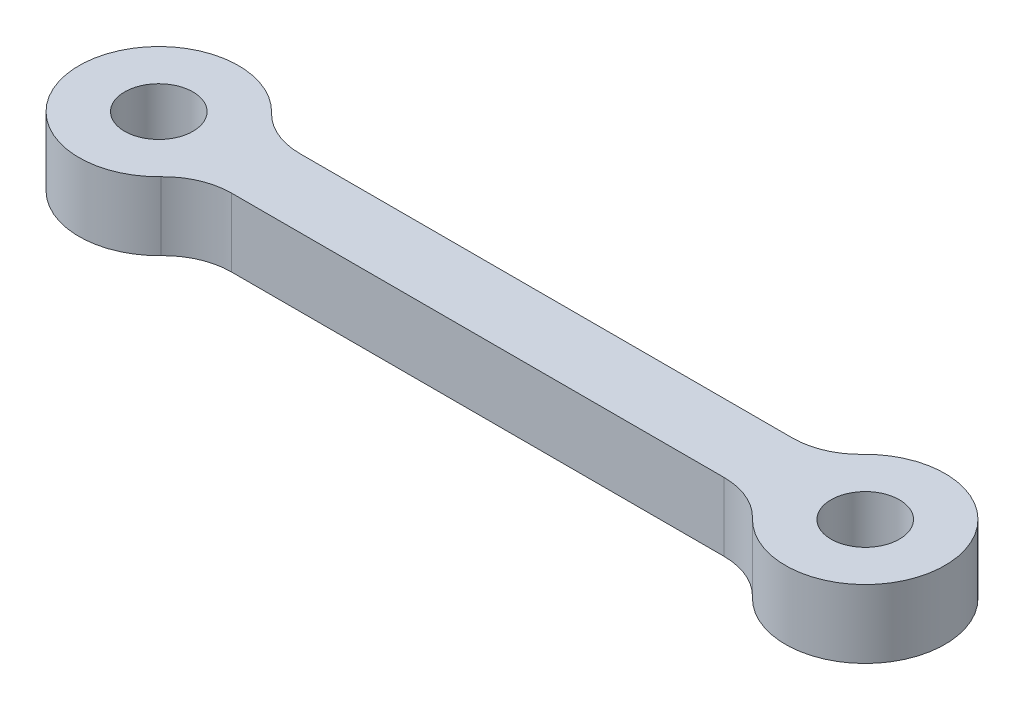
ISO-10303-21;
HEADER;
FILE_DESCRIPTION(('STEP AP214'),'2;1');
FILE_NAME('part.step','',(''),(''),'','','');
FILE_SCHEMA(('AUTOMOTIVE_DESIGN { 1 0 10303 214 1 1 1 1 }'));
ENDSEC;
DATA;
#1=APPLICATION_CONTEXT('core data for automotive mechanical design processes');
#2=APPLICATION_PROTOCOL_DEFINITION('international standard','automotive_design',2000,#1);
#3=PRODUCT_CONTEXT('',#1,'mechanical');
#4=PRODUCT('Part','Part','',(#3));
#5=PRODUCT_RELATED_PRODUCT_CATEGORY('part','',(#4));
#6=PRODUCT_DEFINITION_FORMATION('','',#4);
#7=PRODUCT_DEFINITION_CONTEXT('part definition',#1,'design');
#8=PRODUCT_DEFINITION('design','',#6,#7);
#9=PRODUCT_DEFINITION_SHAPE('','',#8);
#10=(LENGTH_UNIT() NAMED_UNIT(*) SI_UNIT(.MILLI.,.METRE.));
#11=(NAMED_UNIT(*) PLANE_ANGLE_UNIT() SI_UNIT($,.RADIAN.));
#12=(NAMED_UNIT(*) SI_UNIT($,.STERADIAN.) SOLID_ANGLE_UNIT());
#13=UNCERTAINTY_MEASURE_WITH_UNIT(LENGTH_MEASURE(1.E-05),#10,'distance_accuracy_value','');
#14=(GEOMETRIC_REPRESENTATION_CONTEXT(3) GLOBAL_UNCERTAINTY_ASSIGNED_CONTEXT((#13)) GLOBAL_UNIT_ASSIGNED_CONTEXT((#10,
#11,#12)) REPRESENTATION_CONTEXT('',''));
#15=CARTESIAN_POINT('',(0.,0.,0.));
#16=DIRECTION('',(0.,0.,1.));
#17=DIRECTION('',(1.,0.,0.));
#18=AXIS2_PLACEMENT_3D('',#15,#16,#17);
#19=CARTESIAN_POINT('',(31.,3.,0.));
#20=DIRECTION('',(0.,-1.,0.));
#21=DIRECTION('',(0.,0.,-1.));
#22=AXIS2_PLACEMENT_3D('',#19,#20,#21);
#23=CYLINDRICAL_SURFACE('',#22,3.5);
#24=CARTESIAN_POINT('',(31.,3.,0.));
#25=DIRECTION('',(0.,1.,0.));
#26=DIRECTION('',(0.,0.,1.));
#27=AXIS2_PLACEMENT_3D('',#24,#25,#26);
#28=CIRCLE('',#27,3.5);
#29=CARTESIAN_POINT('',(28.4743915139412,3.,2.42307692307692));
#30=VERTEX_POINT('',#29);
#31=CARTESIAN_POINT('',(28.4743915139412,3.,-2.42307692307692));
#32=VERTEX_POINT('',#31);
#33=EDGE_CURVE('E142',#30,#32,#28,.T.);
#34=ORIENTED_EDGE('',*,*,#33,.F.);
#35=DIRECTION('',(0.,-1.,0.));
#36=VECTOR('',#35,1.);
#37=CARTESIAN_POINT('',(28.4743915139412,3.,2.42307692307692));
#38=LINE('',#37,#36);
#39=CARTESIAN_POINT('',(28.4743915139412,0.,2.42307692307692));
#40=VERTEX_POINT('',#39);
#41=EDGE_CURVE('E150',#30,#40,#38,.T.);
#42=ORIENTED_EDGE('',*,*,#41,.T.);
#43=CARTESIAN_POINT('',(31.,0.,0.));
#44=DIRECTION('',(0.,1.,0.));
#45=DIRECTION('',(0.,0.,1.));
#46=AXIS2_PLACEMENT_3D('',#43,#44,#45);
#47=CIRCLE('',#46,3.5);
#48=CARTESIAN_POINT('',(28.4743915139412,0.,-2.42307692307692));
#49=VERTEX_POINT('',#48);
#50=EDGE_CURVE('E167',#40,#49,#47,.T.);
#51=ORIENTED_EDGE('',*,*,#50,.T.);
#52=DIRECTION('',(0.,-1.,0.));
#53=VECTOR('',#52,1.);
#54=CARTESIAN_POINT('',(28.4743915139412,3.,-2.42307692307692));
#55=LINE('',#54,#53);
#56=EDGE_CURVE('E148',#49,#32,#55,.F.);
#57=ORIENTED_EDGE('',*,*,#56,.T.);
#58=EDGE_LOOP('',(#34,#42,#51,#57));
#59=FACE_BOUND('',#58,.T.);
#60=ADVANCED_FACE('F36',(#59),#23,.T.);
#61=CARTESIAN_POINT('',(0.,3.,-1.5));
#62=DIRECTION('',(0.,0.,-1.));
#63=DIRECTION('',(-1.,0.,0.));
#64=AXIS2_PLACEMENT_3D('',#61,#62,#63);
#65=PLANE('',#64);
#66=DIRECTION('',(1.,0.,0.));
#67=VECTOR('',#66,1.);
#68=CARTESIAN_POINT('',(0.,3.,-1.5));
#69=LINE('',#68,#67);
#70=CARTESIAN_POINT('',(4.69041575982343,3.,-1.5));
#71=VERTEX_POINT('',#70);
#72=CARTESIAN_POINT('',(26.3095842401766,3.,-1.5));
#73=VERTEX_POINT('',#72);
#74=EDGE_CURVE('E174',#71,#73,#69,.T.);
#75=ORIENTED_EDGE('',*,*,#74,.T.);
#76=DIRECTION('',(0.,-1.,0.));
#77=VECTOR('',#76,1.);
#78=CARTESIAN_POINT('',(26.3095842401766,3.,-1.5));
#79=LINE('',#78,#77);
#80=CARTESIAN_POINT('',(26.3095842401766,0.,-1.5));
#81=VERTEX_POINT('',#80);
#82=EDGE_CURVE('E113',#73,#81,#79,.T.);
#83=ORIENTED_EDGE('',*,*,#82,.T.);
#84=DIRECTION('',(1.,0.,0.));
#85=VECTOR('',#84,1.);
#86=CARTESIAN_POINT('',(0.,0.,-1.5));
#87=LINE('',#86,#85);
#88=CARTESIAN_POINT('',(4.69041575982343,0.,-1.5));
#89=VERTEX_POINT('',#88);
#90=EDGE_CURVE('E136',#89,#81,#87,.T.);
#91=ORIENTED_EDGE('',*,*,#90,.F.);
#92=DIRECTION('',(0.,-1.,0.));
#93=VECTOR('',#92,1.);
#94=CARTESIAN_POINT('',(4.69041575982343,3.,-1.5));
#95=LINE('',#94,#93);
#96=EDGE_CURVE('E58',#89,#71,#95,.F.);
#97=ORIENTED_EDGE('',*,*,#96,.T.);
#98=EDGE_LOOP('',(#75,#83,#91,#97));
#99=FACE_BOUND('',#98,.T.);
#100=ADVANCED_FACE('F165',(#99),#65,.T.);
#101=CARTESIAN_POINT('',(0.,3.,0.));
#102=DIRECTION('',(0.,-1.,0.));
#103=DIRECTION('',(0.,0.,-1.));
#104=AXIS2_PLACEMENT_3D('',#101,#102,#103);
#105=CYLINDRICAL_SURFACE('',#104,3.5);
#106=CARTESIAN_POINT('',(0.,0.,0.));
#107=DIRECTION('',(0.,1.,0.));
#108=DIRECTION('',(0.,0.,1.));
#109=AXIS2_PLACEMENT_3D('',#106,#107,#108);
#110=CIRCLE('',#109,3.5);
#111=CARTESIAN_POINT('',(2.52560848605877,0.,-2.42307692307692));
#112=VERTEX_POINT('',#111);
#113=CARTESIAN_POINT('',(2.52560848605877,0.,2.42307692307692));
#114=VERTEX_POINT('',#113);
#115=EDGE_CURVE('E131',#112,#114,#110,.T.);
#116=ORIENTED_EDGE('',*,*,#115,.T.);
#117=DIRECTION('',(0.,-1.,0.));
#118=VECTOR('',#117,1.);
#119=CARTESIAN_POINT('',(2.52560848605877,3.,2.42307692307692));
#120=LINE('',#119,#118);
#121=CARTESIAN_POINT('',(2.52560848605877,3.,2.42307692307692));
#122=VERTEX_POINT('',#121);
#123=EDGE_CURVE('E107',#114,#122,#120,.F.);
#124=ORIENTED_EDGE('',*,*,#123,.T.);
#125=CARTESIAN_POINT('',(0.,3.,0.));
#126=DIRECTION('',(0.,1.,0.));
#127=DIRECTION('',(0.,0.,1.));
#128=AXIS2_PLACEMENT_3D('',#125,#126,#127);
#129=CIRCLE('',#128,3.5);
#130=CARTESIAN_POINT('',(2.52560848605877,3.,-2.42307692307692));
#131=VERTEX_POINT('',#130);
#132=EDGE_CURVE('E173',#131,#122,#129,.T.);
#133=ORIENTED_EDGE('',*,*,#132,.F.);
#134=DIRECTION('',(0.,-1.,0.));
#135=VECTOR('',#134,1.);
#136=CARTESIAN_POINT('',(2.52560848605877,3.,-2.42307692307692));
#137=LINE('',#136,#135);
#138=EDGE_CURVE('E123',#131,#112,#137,.T.);
#139=ORIENTED_EDGE('',*,*,#138,.T.);
#140=EDGE_LOOP('',(#116,#124,#133,#139));
#141=FACE_BOUND('',#140,.T.);
#142=ADVANCED_FACE('F176',(#141),#105,.T.);
#143=CARTESIAN_POINT('',(0.,3.,0.));
#144=DIRECTION('',(0.,-1.,0.));
#145=DIRECTION('',(0.,0.,-1.));
#146=AXIS2_PLACEMENT_3D('',#143,#144,#145);
#147=CYLINDRICAL_SURFACE('',#146,1.5);
#148=CARTESIAN_POINT('',(0.,3.,0.));
#149=DIRECTION('',(0.,1.,0.));
#150=DIRECTION('',(0.,0.,1.));
#151=AXIS2_PLACEMENT_3D('',#148,#149,#150);
#152=CIRCLE('',#151,1.5);
#153=CARTESIAN_POINT('',(0.,3.,1.5));
#154=VERTEX_POINT('',#153);
#155=EDGE_CURVE('E178',#154,#154,#152,.T.);
#156=ORIENTED_EDGE('',*,*,#155,.T.);
#157=EDGE_LOOP('',(#156));
#158=FACE_BOUND('',#157,.T.);
#159=CARTESIAN_POINT('',(0.,0.,0.));
#160=DIRECTION('',(0.,1.,0.));
#161=DIRECTION('',(0.,0.,1.));
#162=AXIS2_PLACEMENT_3D('',#159,#160,#161);
#163=CIRCLE('',#162,1.5);
#164=CARTESIAN_POINT('',(0.,0.,1.5));
#165=VERTEX_POINT('',#164);
#166=EDGE_CURVE('E130',#165,#165,#163,.T.);
#167=ORIENTED_EDGE('',*,*,#166,.F.);
#168=EDGE_LOOP('',(#167));
#169=FACE_BOUND('',#168,.T.);
#170=ADVANCED_FACE('F224',(#158,#169),#147,.F.);
#171=CARTESIAN_POINT('',(0.,3.,1.5));
#172=DIRECTION('',(0.,0.,-1.));
#173=DIRECTION('',(-1.,0.,0.));
#174=AXIS2_PLACEMENT_3D('',#171,#172,#173);
#175=PLANE('',#174);
#176=DIRECTION('',(1.,0.,0.));
#177=VECTOR('',#176,1.);
#178=CARTESIAN_POINT('',(0.,3.,1.5));
#179=LINE('',#178,#177);
#180=CARTESIAN_POINT('',(4.69041575982343,3.,1.5));
#181=VERTEX_POINT('',#180);
#182=CARTESIAN_POINT('',(26.3095842401766,3.,1.5));
#183=VERTEX_POINT('',#182);
#184=EDGE_CURVE('E122',#181,#183,#179,.T.);
#185=ORIENTED_EDGE('',*,*,#184,.F.);
#186=DIRECTION('',(0.,1.,0.));
#187=VECTOR('',#186,1.);
#188=CARTESIAN_POINT('',(4.69041575982343,0.,1.5));
#189=LINE('',#188,#187);
#190=CARTESIAN_POINT('',(4.69041575982343,0.,1.5));
#191=VERTEX_POINT('',#190);
#192=EDGE_CURVE('E106',#181,#191,#189,.F.);
#193=ORIENTED_EDGE('',*,*,#192,.T.);
#194=DIRECTION('',(1.,0.,0.));
#195=VECTOR('',#194,1.);
#196=CARTESIAN_POINT('',(0.,0.,1.5));
#197=LINE('',#196,#195);
#198=CARTESIAN_POINT('',(26.3095842401766,0.,1.5));
#199=VERTEX_POINT('',#198);
#200=EDGE_CURVE('E119',#191,#199,#197,.T.);
#201=ORIENTED_EDGE('',*,*,#200,.T.);
#202=DIRECTION('',(0.,1.,0.));
#203=VECTOR('',#202,1.);
#204=CARTESIAN_POINT('',(26.3095842401766,3.,1.5));
#205=LINE('',#204,#203);
#206=EDGE_CURVE('E124',#199,#183,#205,.T.);
#207=ORIENTED_EDGE('',*,*,#206,.T.);
#208=EDGE_LOOP('',(#185,#193,#201,#207));
#209=FACE_BOUND('',#208,.T.);
#210=ADVANCED_FACE('F118',(#209),#175,.F.);
#211=CARTESIAN_POINT('',(31.,3.,0.));
#212=DIRECTION('',(0.,-1.,0.));
#213=DIRECTION('',(0.,0.,-1.));
#214=AXIS2_PLACEMENT_3D('',#211,#212,#213);
#215=CYLINDRICAL_SURFACE('',#214,1.5);
#216=CARTESIAN_POINT('',(31.,3.,0.));
#217=DIRECTION('',(0.,1.,0.));
#218=DIRECTION('',(0.,0.,1.));
#219=AXIS2_PLACEMENT_3D('',#216,#217,#218);
#220=CIRCLE('',#219,1.5);
#221=CARTESIAN_POINT('',(31.,3.,1.5));
#222=VERTEX_POINT('',#221);
#223=EDGE_CURVE('E143',#222,#222,#220,.T.);
#224=ORIENTED_EDGE('',*,*,#223,.T.);
#225=EDGE_LOOP('',(#224));
#226=FACE_BOUND('',#225,.T.);
#227=CARTESIAN_POINT('',(31.,0.,0.));
#228=DIRECTION('',(0.,1.,0.));
#229=DIRECTION('',(0.,0.,1.));
#230=AXIS2_PLACEMENT_3D('',#227,#228,#229);
#231=CIRCLE('',#230,1.5);
#232=CARTESIAN_POINT('',(31.,0.,1.5));
#233=VERTEX_POINT('',#232);
#234=EDGE_CURVE('E134',#233,#233,#231,.T.);
#235=ORIENTED_EDGE('',*,*,#234,.F.);
#236=EDGE_LOOP('',(#235));
#237=FACE_BOUND('',#236,.T.);
#238=ADVANCED_FACE('F218',(#226,#237),#215,.F.);
#239=CARTESIAN_POINT('',(0.,3.,0.));
#240=DIRECTION('',(0.,1.,0.));
#241=DIRECTION('',(0.,0.,1.));
#242=AXIS2_PLACEMENT_3D('',#239,#240,#241);
#243=PLANE('',#242);
#244=ORIENTED_EDGE('',*,*,#184,.T.);
#245=CARTESIAN_POINT('',(26.3095842401766,3.,4.5));
#246=DIRECTION('',(0.,1.,0.));
#247=DIRECTION('',(0.,0.,1.));
#248=AXIS2_PLACEMENT_3D('',#245,#246,#247);
#249=CIRCLE('',#248,3.);
#250=EDGE_CURVE('E158',#183,#30,#249,.F.);
#251=ORIENTED_EDGE('',*,*,#250,.T.);
#252=ORIENTED_EDGE('',*,*,#33,.T.);
#253=CARTESIAN_POINT('',(26.3095842401766,3.,-4.5));
#254=DIRECTION('',(0.,1.,0.));
#255=DIRECTION('',(0.,0.,1.));
#256=AXIS2_PLACEMENT_3D('',#253,#254,#255);
#257=CIRCLE('',#256,3.);
#258=EDGE_CURVE('E51',#32,#73,#257,.F.);
#259=ORIENTED_EDGE('',*,*,#258,.T.);
#260=ORIENTED_EDGE('',*,*,#74,.F.);
#261=CARTESIAN_POINT('',(4.69041575982343,3.,-4.5));
#262=DIRECTION('',(0.,1.,0.));
#263=DIRECTION('',(0.,0.,1.));
#264=AXIS2_PLACEMENT_3D('',#261,#262,#263);
#265=CIRCLE('',#264,3.);
#266=EDGE_CURVE('E11',#71,#131,#265,.F.);
#267=ORIENTED_EDGE('',*,*,#266,.T.);
#268=ORIENTED_EDGE('',*,*,#132,.T.);
#269=CARTESIAN_POINT('',(4.69041575982343,3.,4.5));
#270=DIRECTION('',(0.,1.,0.));
#271=DIRECTION('',(0.,0.,1.));
#272=AXIS2_PLACEMENT_3D('',#269,#270,#271);
#273=CIRCLE('',#272,3.);
#274=EDGE_CURVE('E112',#122,#181,#273,.F.);
#275=ORIENTED_EDGE('',*,*,#274,.T.);
#276=EDGE_LOOP('',(#244,#251,#252,#259,#260,#267,#268,#275));
#277=FACE_BOUND('',#276,.T.);
#278=ORIENTED_EDGE('',*,*,#155,.F.);
#279=EDGE_LOOP('',(#278));
#280=FACE_BOUND('',#279,.T.);
#281=ORIENTED_EDGE('',*,*,#223,.F.);
#282=EDGE_LOOP('',(#281));
#283=FACE_BOUND('',#282,.T.);
#284=ADVANCED_FACE('F171',(#277,#280,#283),#243,.T.);
#285=CARTESIAN_POINT('',(0.,0.,0.));
#286=DIRECTION('',(0.,1.,0.));
#287=DIRECTION('',(0.,0.,1.));
#288=AXIS2_PLACEMENT_3D('',#285,#286,#287);
#289=PLANE('',#288);
#290=ORIENTED_EDGE('',*,*,#50,.F.);
#291=CARTESIAN_POINT('',(26.3095842401766,0.,4.5));
#292=DIRECTION('',(0.,1.,0.));
#293=DIRECTION('',(0.,0.,1.));
#294=AXIS2_PLACEMENT_3D('',#291,#292,#293);
#295=CIRCLE('',#294,3.);
#296=EDGE_CURVE('E129',#40,#199,#295,.T.);
#297=ORIENTED_EDGE('',*,*,#296,.T.);
#298=ORIENTED_EDGE('',*,*,#200,.F.);
#299=CARTESIAN_POINT('',(4.69041575982343,0.,4.5));
#300=DIRECTION('',(0.,1.,0.));
#301=DIRECTION('',(0.,0.,1.));
#302=AXIS2_PLACEMENT_3D('',#299,#300,#301);
#303=CIRCLE('',#302,3.);
#304=EDGE_CURVE('E102',#191,#114,#303,.T.);
#305=ORIENTED_EDGE('',*,*,#304,.T.);
#306=ORIENTED_EDGE('',*,*,#115,.F.);
#307=CARTESIAN_POINT('',(4.69041575982343,0.,-4.5));
#308=DIRECTION('',(0.,1.,0.));
#309=DIRECTION('',(0.,0.,1.));
#310=AXIS2_PLACEMENT_3D('',#307,#308,#309);
#311=CIRCLE('',#310,3.);
#312=EDGE_CURVE('E44',#112,#89,#311,.T.);
#313=ORIENTED_EDGE('',*,*,#312,.T.);
#314=ORIENTED_EDGE('',*,*,#90,.T.);
#315=CARTESIAN_POINT('',(26.3095842401766,0.,-4.5));
#316=DIRECTION('',(0.,1.,0.));
#317=DIRECTION('',(0.,0.,1.));
#318=AXIS2_PLACEMENT_3D('',#315,#316,#317);
#319=CIRCLE('',#318,3.);
#320=EDGE_CURVE('E160',#81,#49,#319,.T.);
#321=ORIENTED_EDGE('',*,*,#320,.T.);
#322=EDGE_LOOP('',(#290,#297,#298,#305,#306,#313,#314,#321));
#323=FACE_BOUND('',#322,.T.);
#324=ORIENTED_EDGE('',*,*,#166,.T.);
#325=EDGE_LOOP('',(#324));
#326=FACE_BOUND('',#325,.T.);
#327=ORIENTED_EDGE('',*,*,#234,.T.);
#328=EDGE_LOOP('',(#327));
#329=FACE_BOUND('',#328,.T.);
#330=ADVANCED_FACE('F127',(#323,#326,#329),#289,.F.);
#331=CARTESIAN_POINT('',(4.69041575982343,3.,4.5));
#332=DIRECTION('',(0.,-1.,0.));
#333=DIRECTION('',(0.,0.,-1.));
#334=AXIS2_PLACEMENT_3D('',#331,#332,#333);
#335=CYLINDRICAL_SURFACE('',#334,3.);
#336=ORIENTED_EDGE('',*,*,#274,.F.);
#337=ORIENTED_EDGE('',*,*,#123,.F.);
#338=ORIENTED_EDGE('',*,*,#304,.F.);
#339=ORIENTED_EDGE('',*,*,#192,.F.);
#340=EDGE_LOOP('',(#336,#337,#338,#339));
#341=FACE_BOUND('',#340,.T.);
#342=ADVANCED_FACE('F105',(#341),#335,.F.);
#343=CARTESIAN_POINT('',(26.3095842401766,3.,4.5));
#344=DIRECTION('',(0.,-1.,0.));
#345=DIRECTION('',(0.,0.,-1.));
#346=AXIS2_PLACEMENT_3D('',#343,#344,#345);
#347=CYLINDRICAL_SURFACE('',#346,3.);
#348=ORIENTED_EDGE('',*,*,#250,.F.);
#349=ORIENTED_EDGE('',*,*,#206,.F.);
#350=ORIENTED_EDGE('',*,*,#296,.F.);
#351=ORIENTED_EDGE('',*,*,#41,.F.);
#352=EDGE_LOOP('',(#348,#349,#350,#351));
#353=FACE_BOUND('',#352,.T.);
#354=ADVANCED_FACE('F195',(#353),#347,.F.);
#355=CARTESIAN_POINT('',(26.3095842401766,3.,-4.5));
#356=DIRECTION('',(0.,-1.,0.));
#357=DIRECTION('',(0.,0.,-1.));
#358=AXIS2_PLACEMENT_3D('',#355,#356,#357);
#359=CYLINDRICAL_SURFACE('',#358,3.);
#360=ORIENTED_EDGE('',*,*,#258,.F.);
#361=ORIENTED_EDGE('',*,*,#56,.F.);
#362=ORIENTED_EDGE('',*,*,#320,.F.);
#363=ORIENTED_EDGE('',*,*,#82,.F.);
#364=EDGE_LOOP('',(#360,#361,#362,#363));
#365=FACE_BOUND('',#364,.T.);
#366=ADVANCED_FACE('F193',(#365),#359,.F.);
#367=CARTESIAN_POINT('',(4.69041575982343,3.,-4.5));
#368=DIRECTION('',(0.,-1.,0.));
#369=DIRECTION('',(0.,0.,-1.));
#370=AXIS2_PLACEMENT_3D('',#367,#368,#369);
#371=CYLINDRICAL_SURFACE('',#370,3.);
#372=ORIENTED_EDGE('',*,*,#266,.F.);
#373=ORIENTED_EDGE('',*,*,#96,.F.);
#374=ORIENTED_EDGE('',*,*,#312,.F.);
#375=ORIENTED_EDGE('',*,*,#138,.F.);
#376=EDGE_LOOP('',(#372,#373,#374,#375));
#377=FACE_BOUND('',#376,.T.);
#378=ADVANCED_FACE('F38',(#377),#371,.F.);
#379=CLOSED_SHELL('',(#60,#100,#142,#170,#210,#238,#284,#330,#342,#354,#366,#378));
#380=MANIFOLD_SOLID_BREP('B2',#379);
#381=ADVANCED_BREP_SHAPE_REPRESENTATION('',(#18,#380),#14);
#382=SHAPE_DEFINITION_REPRESENTATION(#9,#381);
ENDSEC;
END-ISO-10303-21;
